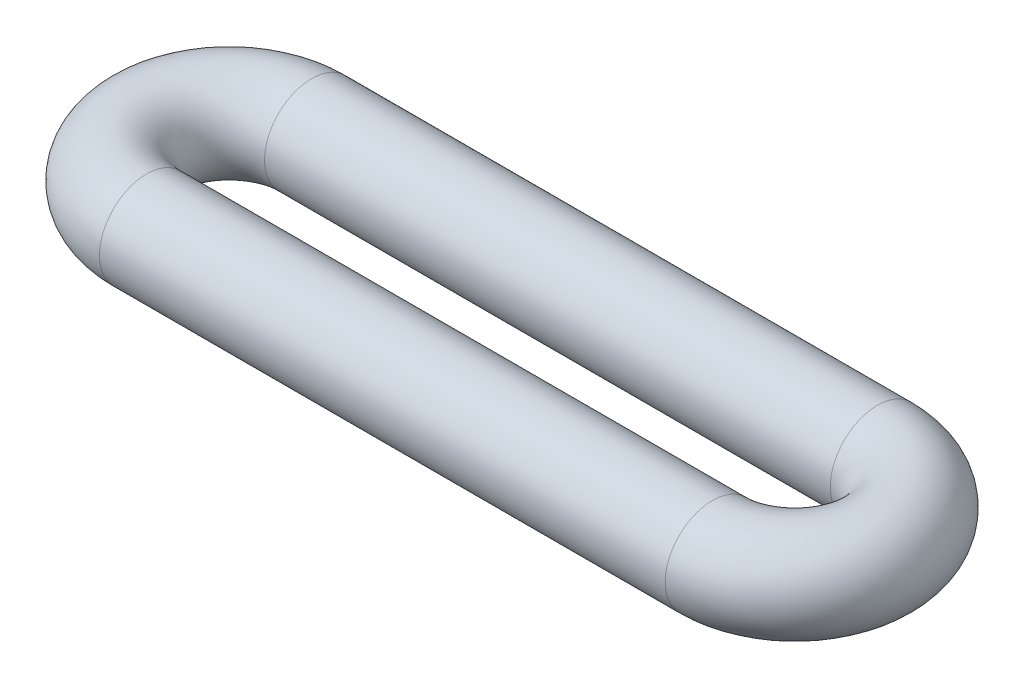
ISO-10303-21;
HEADER;
FILE_DESCRIPTION(('STEP AP214'),'2;1');
FILE_NAME('part.step','',(''),(''),'','','');
FILE_SCHEMA(('AUTOMOTIVE_DESIGN { 1 0 10303 214 1 1 1 1 }'));
ENDSEC;
DATA;
#1=APPLICATION_CONTEXT('core data for automotive mechanical design processes');
#2=APPLICATION_PROTOCOL_DEFINITION('international standard','automotive_design',2000,#1);
#3=PRODUCT_CONTEXT('',#1,'mechanical');
#4=PRODUCT('Part','Part','',(#3));
#5=PRODUCT_RELATED_PRODUCT_CATEGORY('part','',(#4));
#6=PRODUCT_DEFINITION_FORMATION('','',#4);
#7=PRODUCT_DEFINITION_CONTEXT('part definition',#1,'design');
#8=PRODUCT_DEFINITION('design','',#6,#7);
#9=PRODUCT_DEFINITION_SHAPE('','',#8);
#10=(LENGTH_UNIT() NAMED_UNIT(*) SI_UNIT(.MILLI.,.METRE.));
#11=(NAMED_UNIT(*) PLANE_ANGLE_UNIT() SI_UNIT($,.RADIAN.));
#12=(NAMED_UNIT(*) SI_UNIT($,.STERADIAN.) SOLID_ANGLE_UNIT());
#13=UNCERTAINTY_MEASURE_WITH_UNIT(LENGTH_MEASURE(1.E-05),#10,'distance_accuracy_value','');
#14=(GEOMETRIC_REPRESENTATION_CONTEXT(3) GLOBAL_UNCERTAINTY_ASSIGNED_CONTEXT((#13)) GLOBAL_UNIT_ASSIGNED_CONTEXT((#10,
#11,#12)) REPRESENTATION_CONTEXT('',''));
#15=CARTESIAN_POINT('',(0.,0.,0.));
#16=DIRECTION('',(0.,0.,1.));
#17=DIRECTION('',(1.,0.,0.));
#18=AXIS2_PLACEMENT_3D('',#15,#16,#17);
#19=CARTESIAN_POINT('',(0.,0.,0.));
#20=DIRECTION('',(0.,1.,0.));
#21=DIRECTION('',(0.,0.,1.));
#22=AXIS2_PLACEMENT_3D('',#19,#20,#21);
#23=TOROIDAL_SURFACE('',#22,4.375,2.5);
#24=CARTESIAN_POINT('',(0.,0.,-4.375));
#25=DIRECTION('',(1.,0.,0.));
#26=DIRECTION('',(0.,0.,-1.));
#27=AXIS2_PLACEMENT_3D('',#24,#25,#26);
#28=CIRCLE('',#27,2.5);
#29=CARTESIAN_POINT('',(0.,0.,-6.875));
#30=VERTEX_POINT('',#29);
#31=EDGE_CURVE('E55',#30,#30,#28,.T.);
#32=CARTESIAN_POINT('',(0.,0.,4.375));
#33=DIRECTION('',(-1.,0.,0.));
#34=DIRECTION('',(0.,0.,1.));
#35=AXIS2_PLACEMENT_3D('',#32,#33,#34);
#36=CIRCLE('',#35,2.5);
#37=CARTESIAN_POINT('',(0.,0.,6.875));
#38=VERTEX_POINT('',#37);
#39=EDGE_CURVE('E50',#38,#38,#36,.T.);
#40=CARTESIAN_POINT('',(0.,0.,0.));
#41=DIRECTION('',(0.,1.,0.));
#42=DIRECTION('',(0.,0.,1.));
#43=AXIS2_PLACEMENT_3D('',#40,#41,#42);
#44=CIRCLE('',#43,6.875);
#45=EDGE_CURVE('',#30,#38,#44,.T.);
#46=ORIENTED_EDGE('',*,*,#31,.F.);
#47=ORIENTED_EDGE('',*,*,#39,.T.);
#48=ORIENTED_EDGE('',*,*,#45,.T.);
#49=ORIENTED_EDGE('',*,*,#45,.F.);
#50=EDGE_LOOP('',(#46,#48,#47,#49));
#51=FACE_BOUND('',#50,.T.);
#52=ADVANCED_FACE('F37',(#51),#23,.T.);
#53=CARTESIAN_POINT('',(0.,0.,4.375));
#54=DIRECTION('',(1.,0.,0.));
#55=DIRECTION('',(0.,0.,-1.));
#56=AXIS2_PLACEMENT_3D('',#53,#54,#55);
#57=CYLINDRICAL_SURFACE('',#56,2.5);
#58=CARTESIAN_POINT('',(30.,0.,4.375));
#59=DIRECTION('',(-1.,0.,0.));
#60=DIRECTION('',(0.,0.,1.));
#61=AXIS2_PLACEMENT_3D('',#58,#59,#60);
#62=CIRCLE('',#61,2.5);
#63=CARTESIAN_POINT('',(30.,0.,6.875));
#64=VERTEX_POINT('',#63);
#65=EDGE_CURVE('E45',#64,#64,#62,.T.);
#66=ORIENTED_EDGE('',*,*,#65,.T.);
#67=EDGE_LOOP('',(#66));
#68=FACE_BOUND('',#67,.T.);
#69=ORIENTED_EDGE('',*,*,#39,.F.);
#70=EDGE_LOOP('',(#69));
#71=FACE_BOUND('',#70,.T.);
#72=ADVANCED_FACE('F65',(#68,#71),#57,.T.);
#73=CARTESIAN_POINT('',(30.,0.,0.));
#74=DIRECTION('',(0.,1.,0.));
#75=DIRECTION('',(0.,0.,1.));
#76=AXIS2_PLACEMENT_3D('',#73,#74,#75);
#77=TOROIDAL_SURFACE('',#76,4.375,2.5);
#78=CARTESIAN_POINT('',(30.,0.,-4.375));
#79=DIRECTION('',(1.,0.,0.));
#80=DIRECTION('',(0.,0.,-1.));
#81=AXIS2_PLACEMENT_3D('',#78,#79,#80);
#82=CIRCLE('',#81,2.5);
#83=CARTESIAN_POINT('',(30.,0.,-6.875));
#84=VERTEX_POINT('',#83);
#85=EDGE_CURVE('E10',#84,#84,#82,.T.);
#86=CARTESIAN_POINT('',(30.,0.,0.));
#87=DIRECTION('',(0.,1.,0.));
#88=DIRECTION('',(0.,0.,1.));
#89=AXIS2_PLACEMENT_3D('',#86,#87,#88);
#90=CIRCLE('',#89,6.875);
#91=EDGE_CURVE('',#64,#84,#90,.T.);
#92=ORIENTED_EDGE('',*,*,#65,.F.);
#93=ORIENTED_EDGE('',*,*,#85,.T.);
#94=ORIENTED_EDGE('',*,*,#91,.T.);
#95=ORIENTED_EDGE('',*,*,#91,.F.);
#96=EDGE_LOOP('',(#92,#94,#93,#95));
#97=FACE_BOUND('',#96,.T.);
#98=ADVANCED_FACE('F71',(#97),#77,.T.);
#99=CARTESIAN_POINT('',(30.,0.,-4.375));
#100=DIRECTION('',(-1.,0.,0.));
#101=DIRECTION('',(0.,0.,1.));
#102=AXIS2_PLACEMENT_3D('',#99,#100,#101);
#103=CYLINDRICAL_SURFACE('',#102,2.5);
#104=ORIENTED_EDGE('',*,*,#31,.T.);
#105=EDGE_LOOP('',(#104));
#106=FACE_BOUND('',#105,.T.);
#107=ORIENTED_EDGE('',*,*,#85,.F.);
#108=EDGE_LOOP('',(#107));
#109=FACE_BOUND('',#108,.T.);
#110=ADVANCED_FACE('F39',(#106,#109),#103,.T.);
#111=CLOSED_SHELL('',(#52,#72,#98,#110));
#112=MANIFOLD_SOLID_BREP('B2',#111);
#113=ADVANCED_BREP_SHAPE_REPRESENTATION('',(#18,#112),#14);
#114=SHAPE_DEFINITION_REPRESENTATION(#9,#113);
ENDSEC;
END-ISO-10303-21;
